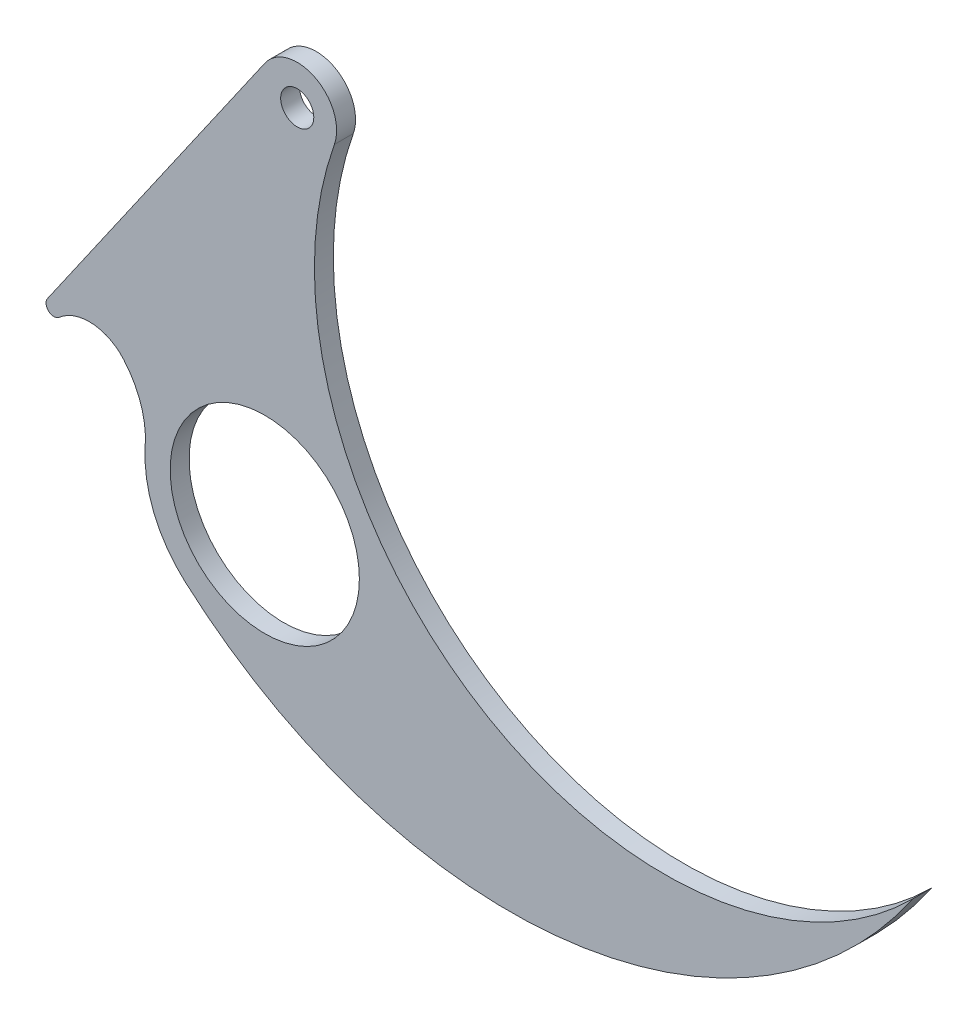
ISO-10303-21;
HEADER;
FILE_DESCRIPTION(('STEP AP214'),'2;1');
FILE_NAME('part.step','',(''),(''),'','','');
FILE_SCHEMA(('AUTOMOTIVE_DESIGN { 1 0 10303 214 1 1 1 1 }'));
ENDSEC;
DATA;
#1=APPLICATION_CONTEXT('core data for automotive mechanical design processes');
#2=APPLICATION_PROTOCOL_DEFINITION('international standard','automotive_design',2000,#1);
#3=PRODUCT_CONTEXT('',#1,'mechanical');
#4=PRODUCT('Part','Part','',(#3));
#5=PRODUCT_RELATED_PRODUCT_CATEGORY('part','',(#4));
#6=PRODUCT_DEFINITION_FORMATION('','',#4);
#7=PRODUCT_DEFINITION_CONTEXT('part definition',#1,'design');
#8=PRODUCT_DEFINITION('design','',#6,#7);
#9=PRODUCT_DEFINITION_SHAPE('','',#8);
#10=(LENGTH_UNIT() NAMED_UNIT(*) SI_UNIT(.MILLI.,.METRE.));
#11=(NAMED_UNIT(*) PLANE_ANGLE_UNIT() SI_UNIT($,.RADIAN.));
#12=(NAMED_UNIT(*) SI_UNIT($,.STERADIAN.) SOLID_ANGLE_UNIT());
#13=UNCERTAINTY_MEASURE_WITH_UNIT(LENGTH_MEASURE(1.E-05),#10,'distance_accuracy_value','');
#14=(GEOMETRIC_REPRESENTATION_CONTEXT(3) GLOBAL_UNCERTAINTY_ASSIGNED_CONTEXT((#13)) GLOBAL_UNIT_ASSIGNED_CONTEXT((#10,
#11,#12)) REPRESENTATION_CONTEXT('',''));
#15=CARTESIAN_POINT('',(0.,0.,0.));
#16=DIRECTION('',(0.,0.,1.));
#17=DIRECTION('',(1.,0.,0.));
#18=AXIS2_PLACEMENT_3D('',#15,#16,#17);
#19=CARTESIAN_POINT('',(77.6479791245522,87.5202338769307,-5.99999999999999));
#20=DIRECTION('',(0.,0.,0.999999999999999));
#21=DIRECTION('',(0.999999999999999,0.,0.));
#22=AXIS2_PLACEMENT_3D('',#19,#20,#21);
#23=CYLINDRICAL_SURFACE('',#22,155.);
#24=CARTESIAN_POINT('',(77.6479791245522,87.5202338769307,0.));
#25=DIRECTION('',(0.,0.,0.999999999999999));
#26=DIRECTION('',(0.999999999999999,0.,0.));
#27=AXIS2_PLACEMENT_3D('',#24,#25,#26);
#28=CIRCLE('',#27,155.);
#29=CARTESIAN_POINT('',(-25.2190017669584,-28.4253751053213,0.));
#30=VERTEX_POINT('',#29);
#31=CARTESIAN_POINT('',(205.574554401651,0.,0.));
#32=VERTEX_POINT('',#31);
#33=EDGE_CURVE('E131',#30,#32,#28,.T.);
#34=ORIENTED_EDGE('',*,*,#33,.F.);
#35=DIRECTION('',(0.,0.,0.999999999999999));
#36=VECTOR('',#35,1.);
#37=CARTESIAN_POINT('',(-25.2190017669584,-28.4253751053213,-5.99999999999999));
#38=LINE('',#37,#36);
#39=CARTESIAN_POINT('',(-25.2190017669584,-28.4253751053213,-5.99999999999999));
#40=VERTEX_POINT('',#39);
#41=EDGE_CURVE('E11',#40,#30,#38,.T.);
#42=ORIENTED_EDGE('',*,*,#41,.F.);
#43=CARTESIAN_POINT('',(77.6479791245522,87.5202338769307,-5.99999999999999));
#44=DIRECTION('',(0.,0.,0.999999999999999));
#45=DIRECTION('',(0.999999999999999,0.,0.));
#46=AXIS2_PLACEMENT_3D('',#43,#44,#45);
#47=CIRCLE('',#46,155.);
#48=CARTESIAN_POINT('',(205.574554401651,0.,-5.99999999999999));
#49=VERTEX_POINT('',#48);
#50=EDGE_CURVE('E152',#40,#49,#47,.T.);
#51=ORIENTED_EDGE('',*,*,#50,.T.);
#52=DIRECTION('',(0.,0.,0.999999999999999));
#53=VECTOR('',#52,1.);
#54=CARTESIAN_POINT('',(205.574554401651,0.,-5.99999999999999));
#55=LINE('',#54,#53);
#56=EDGE_CURVE('E37',#49,#32,#55,.T.);
#57=ORIENTED_EDGE('',*,*,#56,.T.);
#58=EDGE_LOOP('',(#34,#42,#51,#57));
#59=FACE_BOUND('',#58,.T.);
#60=ADVANCED_FACE('F34',(#59),#23,.T.);
#61=CARTESIAN_POINT('',(0.,0.,-5.99999999999999));
#62=DIRECTION('',(0.,0.,0.999999999999999));
#63=DIRECTION('',(0.999999999999999,0.,0.));
#64=AXIS2_PLACEMENT_3D('',#61,#62,#63);
#65=CYLINDRICAL_SURFACE('',#64,38.000000000001);
#66=CARTESIAN_POINT('',(0.,0.,0.));
#67=DIRECTION('',(0.,0.,0.999999999999999));
#68=DIRECTION('',(0.999999999999999,0.,0.));
#69=AXIS2_PLACEMENT_3D('',#66,#67,#68);
#70=CIRCLE('',#69,38.000000000001);
#71=CARTESIAN_POINT('',(-37.9087578173794,2.63174480969359,0.));
#72=VERTEX_POINT('',#71);
#73=EDGE_CURVE('E150',#72,#30,#70,.T.);
#74=ORIENTED_EDGE('',*,*,#73,.F.);
#75=DIRECTION('',(0.,0.,0.999999999999999));
#76=VECTOR('',#75,1.);
#77=CARTESIAN_POINT('',(-37.9087578173793,2.63174480969357,-5.99999999999999));
#78=LINE('',#77,#76);
#79=CARTESIAN_POINT('',(-37.9087578173793,2.63174480969357,-5.99999999999999));
#80=VERTEX_POINT('',#79);
#81=EDGE_CURVE('E43',#80,#72,#78,.T.);
#82=ORIENTED_EDGE('',*,*,#81,.F.);
#83=CARTESIAN_POINT('',(0.,0.,-5.99999999999999));
#84=DIRECTION('',(0.,0.,0.999999999999999));
#85=DIRECTION('',(0.999999999999999,0.,0.));
#86=AXIS2_PLACEMENT_3D('',#83,#84,#85);
#87=CIRCLE('',#86,38.000000000001);
#88=EDGE_CURVE('E121',#80,#40,#87,.T.);
#89=ORIENTED_EDGE('',*,*,#88,.T.);
#90=ORIENTED_EDGE('',*,*,#41,.T.);
#91=EDGE_LOOP('',(#74,#82,#89,#90));
#92=FACE_BOUND('',#91,.T.);
#93=ADVANCED_FACE('F164',(#92),#65,.T.);
#94=CARTESIAN_POINT('',(-65.6795100074408,4.55967748661117,-6.));
#95=DIRECTION('',(0.,0.,0.999999999999999));
#96=DIRECTION('',(0.999999999999999,0.,0.));
#97=AXIS2_PLACEMENT_3D('',#94,#95,#96);
#98=CYLINDRICAL_SURFACE('',#97,27.8375933156691);
#99=CARTESIAN_POINT('',(-65.6795100074409,4.55967748661119,0.));
#100=DIRECTION('',(0.,0.,-0.999999999999999));
#101=DIRECTION('',(-0.999999999999999,0.,0.));
#102=AXIS2_PLACEMENT_3D('',#99,#100,#101);
#103=CIRCLE('',#102,27.8375933156691);
#104=CARTESIAN_POINT('',(-44.7503372460534,22.9145495682298,0.));
#105=VERTEX_POINT('',#104);
#106=EDGE_CURVE('E108',#105,#72,#103,.T.);
#107=ORIENTED_EDGE('',*,*,#106,.F.);
#108=DIRECTION('',(0.,0.,0.999999999999999));
#109=VECTOR('',#108,1.);
#110=CARTESIAN_POINT('',(-44.7503372460533,22.9145495682298,-5.99999999999999));
#111=LINE('',#110,#109);
#112=CARTESIAN_POINT('',(-44.7503372460533,22.9145495682298,-5.99999999999999));
#113=VERTEX_POINT('',#112);
#114=EDGE_CURVE('E103',#113,#105,#111,.T.);
#115=ORIENTED_EDGE('',*,*,#114,.F.);
#116=CARTESIAN_POINT('',(-65.6795100074408,4.55967748661117,-6.));
#117=DIRECTION('',(0.,0.,-0.999999999999999));
#118=DIRECTION('',(-0.999999999999999,0.,0.));
#119=AXIS2_PLACEMENT_3D('',#116,#117,#118);
#120=CIRCLE('',#119,27.8375933156691);
#121=EDGE_CURVE('E106',#113,#80,#120,.T.);
#122=ORIENTED_EDGE('',*,*,#121,.T.);
#123=ORIENTED_EDGE('',*,*,#81,.T.);
#124=EDGE_LOOP('',(#107,#115,#122,#123));
#125=FACE_BOUND('',#124,.T.);
#126=ADVANCED_FACE('F105',(#125),#98,.F.);
#127=CARTESIAN_POINT('',(-55.6518904657888,13.3538938691014,-5.99999999999999));
#128=DIRECTION('',(0.,0.,0.999999999999999));
#129=DIRECTION('',(0.999999999999999,0.,0.));
#130=AXIS2_PLACEMENT_3D('',#127,#128,#129);
#131=CYLINDRICAL_SURFACE('',#130,14.5);
#132=CARTESIAN_POINT('',(-55.6518904657889,13.3538938691014,0.));
#133=DIRECTION('',(0.,0.,-0.999999999999999));
#134=DIRECTION('',(0.999999999999999,0.,0.));
#135=AXIS2_PLACEMENT_3D('',#132,#133,#134);
#136=CIRCLE('',#135,14.5);
#137=CARTESIAN_POINT('',(-65.2125461649173,24.2554470888368,0.));
#138=VERTEX_POINT('',#137);
#139=EDGE_CURVE('E147',#138,#105,#136,.T.);
#140=ORIENTED_EDGE('',*,*,#139,.F.);
#141=DIRECTION('',(0.,0.,0.999999999999999));
#142=VECTOR('',#141,1.);
#143=CARTESIAN_POINT('',(-65.2125461649172,24.2554470888368,-5.99999999999999));
#144=LINE('',#143,#142);
#145=CARTESIAN_POINT('',(-65.2125461649172,24.2554470888368,-5.99999999999999));
#146=VERTEX_POINT('',#145);
#147=EDGE_CURVE('E113',#146,#138,#144,.T.);
#148=ORIENTED_EDGE('',*,*,#147,.F.);
#149=CARTESIAN_POINT('',(-55.6518904657888,13.3538938691014,-5.99999999999999));
#150=DIRECTION('',(0.,0.,-0.999999999999999));
#151=DIRECTION('',(0.999999999999999,0.,0.));
#152=AXIS2_PLACEMENT_3D('',#149,#150,#151);
#153=CIRCLE('',#152,14.5);
#154=EDGE_CURVE('E119',#146,#113,#153,.T.);
#155=ORIENTED_EDGE('',*,*,#154,.T.);
#156=ORIENTED_EDGE('',*,*,#114,.T.);
#157=EDGE_LOOP('',(#140,#148,#155,#156));
#158=FACE_BOUND('',#157,.T.);
#159=ADVANCED_FACE('F123',(#158),#131,.F.);
#160=CARTESIAN_POINT('',(-66.86093507856,26.1350252301705,-5.99999999999999));
#161=DIRECTION('',(0.,0.,0.999999999999999));
#162=DIRECTION('',(0.999999999999999,0.,0.));
#163=AXIS2_PLACEMENT_3D('',#160,#161,#162);
#164=CYLINDRICAL_SURFACE('',#163,2.5);
#165=CARTESIAN_POINT('',(-66.8609350785601,26.1350252301705,0.));
#166=DIRECTION('',(0.,0.,0.999999999999999));
#167=DIRECTION('',(0.999999999999999,0.,0.));
#168=AXIS2_PLACEMENT_3D('',#165,#166,#167);
#169=CIRCLE('',#168,2.5);
#170=CARTESIAN_POINT('',(-68.9133422638345,27.5624791684235,0.));
#171=VERTEX_POINT('',#170);
#172=EDGE_CURVE('E144',#171,#138,#169,.T.);
#173=ORIENTED_EDGE('',*,*,#172,.F.);
#174=DIRECTION('',(0.,0.,0.999999999999999));
#175=VECTOR('',#174,1.);
#176=CARTESIAN_POINT('',(-68.9133422638344,27.5624791684235,-5.99999999999999));
#177=LINE('',#176,#175);
#178=CARTESIAN_POINT('',(-68.9133422638344,27.5624791684235,-5.99999999999999));
#179=VERTEX_POINT('',#178);
#180=EDGE_CURVE('E156',#179,#171,#177,.T.);
#181=ORIENTED_EDGE('',*,*,#180,.F.);
#182=CARTESIAN_POINT('',(-66.86093507856,26.1350252301705,-5.99999999999999));
#183=DIRECTION('',(0.,0.,0.999999999999999));
#184=DIRECTION('',(0.999999999999999,0.,0.));
#185=AXIS2_PLACEMENT_3D('',#182,#183,#184);
#186=CIRCLE('',#185,2.5);
#187=EDGE_CURVE('E124',#179,#146,#186,.T.);
#188=ORIENTED_EDGE('',*,*,#187,.T.);
#189=ORIENTED_EDGE('',*,*,#147,.T.);
#190=EDGE_LOOP('',(#173,#181,#188,#189));
#191=FACE_BOUND('',#190,.T.);
#192=ADVANCED_FACE('F177',(#191),#164,.T.);
#193=CARTESIAN_POINT('',(0.0334175607414749,126.694802442219,-5.99999999999999));
#194=DIRECTION('',(-0.820962874109764,0.570981575301195,0.));
#195=DIRECTION('',(-0.570981575301196,-0.820962874109764,0.));
#196=AXIS2_PLACEMENT_3D('',#193,#194,#195);
#197=PLANE('',#196);
#198=DIRECTION('',(-0.570981575301196,-0.820962874109764,0.));
#199=VECTOR('',#198,1.);
#200=CARTESIAN_POINT('',(0.0334175607414749,126.694802442219,0.));
#201=LINE('',#200,#199);
#202=CARTESIAN_POINT('',(0.0334175607414749,126.694802442219,0.));
#203=VERTEX_POINT('',#202);
#204=EDGE_CURVE('E141',#203,#171,#201,.T.);
#205=ORIENTED_EDGE('',*,*,#204,.F.);
#206=DIRECTION('',(0.,0.,0.999999999999999));
#207=VECTOR('',#206,1.);
#208=CARTESIAN_POINT('',(0.0334175607414749,126.694802442219,-5.99999999999999));
#209=LINE('',#208,#207);
#210=CARTESIAN_POINT('',(0.0334175607414749,126.694802442219,-5.99999999999999));
#211=VERTEX_POINT('',#210);
#212=EDGE_CURVE('E158',#211,#203,#209,.T.);
#213=ORIENTED_EDGE('',*,*,#212,.F.);
#214=DIRECTION('',(-0.570981575301196,-0.820962874109764,0.));
#215=VECTOR('',#214,1.);
#216=CARTESIAN_POINT('',(0.0334175607414749,126.694802442219,-5.99999999999999));
#217=LINE('',#216,#215);
#218=EDGE_CURVE('E126',#211,#179,#217,.T.);
#219=ORIENTED_EDGE('',*,*,#218,.T.);
#220=ORIENTED_EDGE('',*,*,#180,.T.);
#221=EDGE_LOOP('',(#205,#213,#219,#220));
#222=FACE_BOUND('',#221,.T.);
#223=ADVANCED_FACE('F180',(#222),#197,.T.);
#224=CARTESIAN_POINT('',(10.2954534871134,119.557532750955,-5.99999999999999));
#225=DIRECTION('',(0.,0.,0.999999999999999));
#226=DIRECTION('',(0.999999999999999,0.,0.));
#227=AXIS2_PLACEMENT_3D('',#224,#225,#226);
#228=CYLINDRICAL_SURFACE('',#227,12.4999999999999);
#229=CARTESIAN_POINT('',(10.2954534871134,119.557532750955,0.));
#230=DIRECTION('',(0.,0.,0.999999999999999));
#231=DIRECTION('',(0.999999999999999,0.,0.));
#232=AXIS2_PLACEMENT_3D('',#229,#230,#231);
#233=CIRCLE('',#232,12.4999999999999);
#234=CARTESIAN_POINT('',(22.081438439852,115.393333104706,0.));
#235=VERTEX_POINT('',#234);
#236=EDGE_CURVE('E138',#235,#203,#233,.T.);
#237=ORIENTED_EDGE('',*,*,#236,.F.);
#238=DIRECTION('',(0.,0.,0.999999999999999));
#239=VECTOR('',#238,1.);
#240=CARTESIAN_POINT('',(22.081438439852,115.393333104706,-5.99999999999999));
#241=LINE('',#240,#239);
#242=CARTESIAN_POINT('',(22.081438439852,115.393333104706,-5.99999999999999));
#243=VERTEX_POINT('',#242);
#244=EDGE_CURVE('E159',#243,#235,#241,.T.);
#245=ORIENTED_EDGE('',*,*,#244,.F.);
#246=CARTESIAN_POINT('',(10.2954534871134,119.557532750955,-5.99999999999999));
#247=DIRECTION('',(0.,0.,0.999999999999999));
#248=DIRECTION('',(0.999999999999999,0.,0.));
#249=AXIS2_PLACEMENT_3D('',#246,#247,#248);
#250=CIRCLE('',#249,12.4999999999999);
#251=EDGE_CURVE('E226',#243,#211,#250,.T.);
#252=ORIENTED_EDGE('',*,*,#251,.T.);
#253=ORIENTED_EDGE('',*,*,#212,.T.);
#254=EDGE_LOOP('',(#237,#245,#252,#253));
#255=FACE_BOUND('',#254,.T.);
#256=ADVANCED_FACE('F184',(#255),#228,.T.);
#257=CARTESIAN_POINT('',(126.83614423674,78.3816187192302,-5.99999999999999));
#258=DIRECTION('',(0.,0.,0.999999999999999));
#259=DIRECTION('',(0.999999999999999,0.,0.));
#260=AXIS2_PLACEMENT_3D('',#257,#258,#259);
#261=CYLINDRICAL_SURFACE('',#260,111.10092433614);
#262=CARTESIAN_POINT('',(126.83614423674,78.3816187192302,0.));
#263=DIRECTION('',(0.,0.,-0.999999999999999));
#264=DIRECTION('',(0.999999999999999,0.,0.));
#265=AXIS2_PLACEMENT_3D('',#262,#263,#264);
#266=CIRCLE('',#265,111.10092433614);
#267=EDGE_CURVE('E134',#32,#235,#266,.T.);
#268=ORIENTED_EDGE('',*,*,#267,.F.);
#269=ORIENTED_EDGE('',*,*,#56,.F.);
#270=CARTESIAN_POINT('',(126.83614423674,78.3816187192302,-5.99999999999999));
#271=DIRECTION('',(0.,0.,-0.999999999999999));
#272=DIRECTION('',(0.999999999999999,0.,0.));
#273=AXIS2_PLACEMENT_3D('',#270,#271,#272);
#274=CIRCLE('',#273,111.10092433614);
#275=EDGE_CURVE('E224',#49,#243,#274,.T.);
#276=ORIENTED_EDGE('',*,*,#275,.T.);
#277=ORIENTED_EDGE('',*,*,#244,.T.);
#278=EDGE_LOOP('',(#268,#269,#276,#277));
#279=FACE_BOUND('',#278,.T.);
#280=ADVANCED_FACE('F161',(#279),#261,.F.);
#281=CARTESIAN_POINT('',(77.6479791245522,87.5202338769307,-5.99999999999999));
#282=DIRECTION('',(0.,0.,0.999999999999999));
#283=DIRECTION('',(0.999999999999999,0.,0.));
#284=AXIS2_PLACEMENT_3D('',#281,#282,#283);
#285=PLANE('',#284);
#286=CARTESIAN_POINT('',(0.,0.,-5.99999999999999));
#287=DIRECTION('',(0.,0.,0.999999999999999));
#288=DIRECTION('',(0.999999999999999,0.,0.));
#289=AXIS2_PLACEMENT_3D('',#286,#287,#288);
#290=CIRCLE('',#289,30.);
#291=CARTESIAN_POINT('',(30.,0.,-5.99999999999999));
#292=VERTEX_POINT('',#291);
#293=EDGE_CURVE('E211',#292,#292,#290,.T.);
#294=ORIENTED_EDGE('',*,*,#293,.T.);
#295=EDGE_LOOP('',(#294));
#296=FACE_BOUND('',#295,.T.);
#297=CARTESIAN_POINT('',(10.2954534871134,119.557532750955,-5.99999999999999));
#298=DIRECTION('',(0.,0.,0.999999999999999));
#299=DIRECTION('',(0.999999999999999,0.,0.));
#300=AXIS2_PLACEMENT_3D('',#297,#298,#299);
#301=CIRCLE('',#300,5.24999999999992);
#302=CARTESIAN_POINT('',(15.5454534871134,119.557532750955,-5.99999999999999));
#303=VERTEX_POINT('',#302);
#304=EDGE_CURVE('E135',#303,#303,#301,.T.);
#305=ORIENTED_EDGE('',*,*,#304,.T.);
#306=EDGE_LOOP('',(#305));
#307=FACE_BOUND('',#306,.T.);
#308=ORIENTED_EDGE('',*,*,#50,.F.);
#309=ORIENTED_EDGE('',*,*,#88,.F.);
#310=ORIENTED_EDGE('',*,*,#121,.F.);
#311=ORIENTED_EDGE('',*,*,#154,.F.);
#312=ORIENTED_EDGE('',*,*,#187,.F.);
#313=ORIENTED_EDGE('',*,*,#218,.F.);
#314=ORIENTED_EDGE('',*,*,#251,.F.);
#315=ORIENTED_EDGE('',*,*,#275,.F.);
#316=EDGE_LOOP('',(#308,#309,#310,#311,#312,#313,#314,#315));
#317=FACE_BOUND('',#316,.T.);
#318=ADVANCED_FACE('F117',(#296,#307,#317),#285,.F.);
#319=CARTESIAN_POINT('',(77.6479791245522,87.5202338769307,0.));
#320=DIRECTION('',(0.,0.,0.999999999999999));
#321=DIRECTION('',(0.999999999999999,0.,0.));
#322=AXIS2_PLACEMENT_3D('',#319,#320,#321);
#323=PLANE('',#322);
#324=CARTESIAN_POINT('',(0.,0.,0.));
#325=DIRECTION('',(0.,0.,0.999999999999999));
#326=DIRECTION('',(0.999999999999999,0.,0.));
#327=AXIS2_PLACEMENT_3D('',#324,#325,#326);
#328=CIRCLE('',#327,30.);
#329=CARTESIAN_POINT('',(30.,0.,0.));
#330=VERTEX_POINT('',#329);
#331=EDGE_CURVE('E214',#330,#330,#328,.T.);
#332=ORIENTED_EDGE('',*,*,#331,.F.);
#333=EDGE_LOOP('',(#332));
#334=FACE_BOUND('',#333,.T.);
#335=CARTESIAN_POINT('',(10.2954534871134,119.557532750955,0.));
#336=DIRECTION('',(0.,0.,0.999999999999999));
#337=DIRECTION('',(0.999999999999999,0.,0.));
#338=AXIS2_PLACEMENT_3D('',#335,#336,#337);
#339=CIRCLE('',#338,5.24999999999992);
#340=CARTESIAN_POINT('',(15.5454534871133,119.557532750955,0.));
#341=VERTEX_POINT('',#340);
#342=EDGE_CURVE('E216',#341,#341,#339,.T.);
#343=ORIENTED_EDGE('',*,*,#342,.F.);
#344=EDGE_LOOP('',(#343));
#345=FACE_BOUND('',#344,.T.);
#346=ORIENTED_EDGE('',*,*,#33,.T.);
#347=ORIENTED_EDGE('',*,*,#267,.T.);
#348=ORIENTED_EDGE('',*,*,#236,.T.);
#349=ORIENTED_EDGE('',*,*,#204,.T.);
#350=ORIENTED_EDGE('',*,*,#172,.T.);
#351=ORIENTED_EDGE('',*,*,#139,.T.);
#352=ORIENTED_EDGE('',*,*,#106,.T.);
#353=ORIENTED_EDGE('',*,*,#73,.T.);
#354=EDGE_LOOP('',(#346,#347,#348,#349,#350,#351,#352,#353));
#355=FACE_BOUND('',#354,.T.);
#356=ADVANCED_FACE('F163',(#334,#345,#355),#323,.T.);
#357=CARTESIAN_POINT('',(10.2954534871134,119.557532750955,-5.99999999999999));
#358=DIRECTION('',(0.,0.,0.999999999999999));
#359=DIRECTION('',(0.999999999999999,0.,0.));
#360=AXIS2_PLACEMENT_3D('',#357,#358,#359);
#361=CYLINDRICAL_SURFACE('',#360,5.24999999999992);
#362=ORIENTED_EDGE('',*,*,#304,.F.);
#363=EDGE_LOOP('',(#362));
#364=FACE_BOUND('',#363,.T.);
#365=ORIENTED_EDGE('',*,*,#342,.T.);
#366=EDGE_LOOP('',(#365));
#367=FACE_BOUND('',#366,.T.);
#368=ADVANCED_FACE('F196',(#364,#367),#361,.F.);
#369=CARTESIAN_POINT('',(0.,0.,-5.99999999999999));
#370=DIRECTION('',(0.,0.,0.999999999999999));
#371=DIRECTION('',(0.999999999999999,0.,0.));
#372=AXIS2_PLACEMENT_3D('',#369,#370,#371);
#373=CYLINDRICAL_SURFACE('',#372,30.);
#374=ORIENTED_EDGE('',*,*,#293,.F.);
#375=EDGE_LOOP('',(#374));
#376=FACE_BOUND('',#375,.T.);
#377=ORIENTED_EDGE('',*,*,#331,.T.);
#378=EDGE_LOOP('',(#377));
#379=FACE_BOUND('',#378,.T.);
#380=ADVANCED_FACE('F203',(#376,#379),#373,.F.);
#381=CLOSED_SHELL('',(#60,#93,#126,#159,#192,#223,#256,#280,#318,#356,#368,#380));
#382=MANIFOLD_SOLID_BREP('B2',#381);
#383=ADVANCED_BREP_SHAPE_REPRESENTATION('',(#18,#382),#14);
#384=SHAPE_DEFINITION_REPRESENTATION(#9,#383);
ENDSEC;
END-ISO-10303-21;
